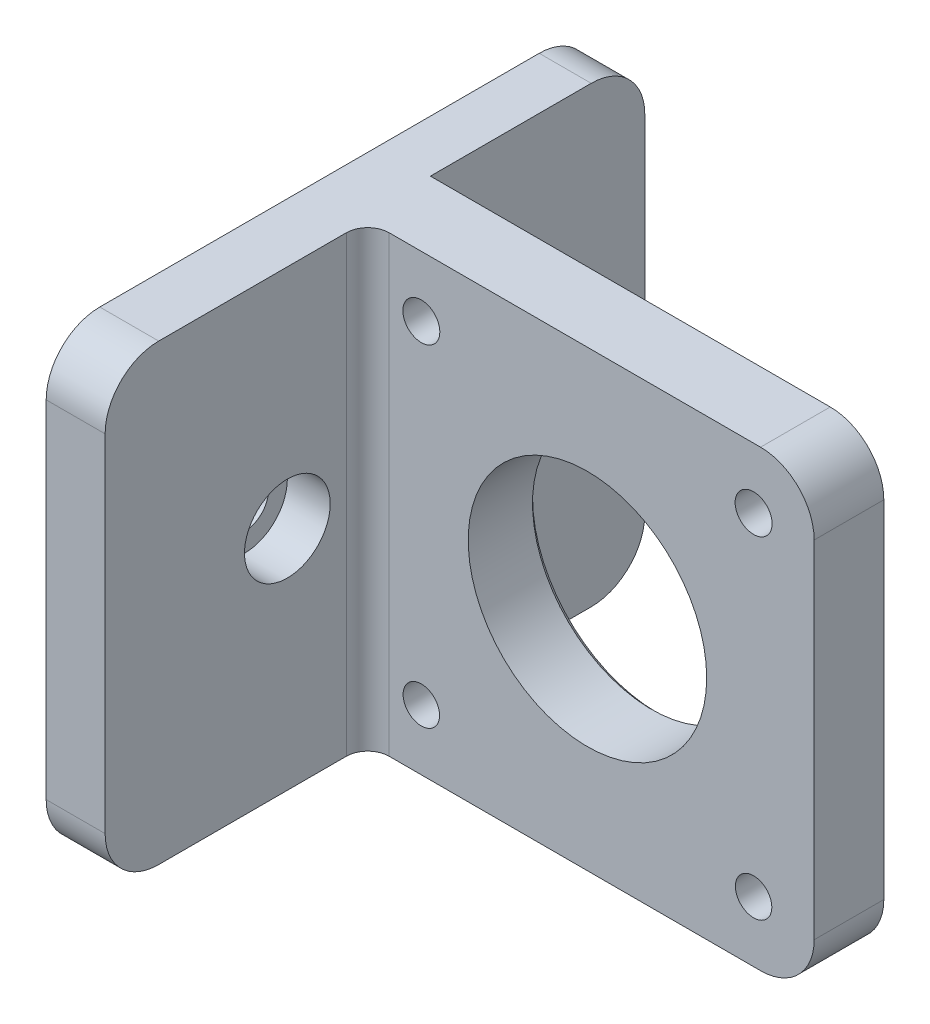
ISO-10303-21;
HEADER;
FILE_DESCRIPTION(('STEP AP214'),'2;1');
FILE_NAME('part.step','',(''),(''),'','','');
FILE_SCHEMA(('AUTOMOTIVE_DESIGN { 1 0 10303 214 1 1 1 1 }'));
ENDSEC;
DATA;
#1=APPLICATION_CONTEXT('core data for automotive mechanical design processes');
#2=APPLICATION_PROTOCOL_DEFINITION('international standard','automotive_design',2000,#1);
#3=PRODUCT_CONTEXT('',#1,'mechanical');
#4=PRODUCT('Part','Part','',(#3));
#5=PRODUCT_RELATED_PRODUCT_CATEGORY('part','',(#4));
#6=PRODUCT_DEFINITION_FORMATION('','',#4);
#7=PRODUCT_DEFINITION_CONTEXT('part definition',#1,'design');
#8=PRODUCT_DEFINITION('design','',#6,#7);
#9=PRODUCT_DEFINITION_SHAPE('','',#8);
#10=(LENGTH_UNIT() NAMED_UNIT(*) SI_UNIT(.MILLI.,.METRE.));
#11=(NAMED_UNIT(*) PLANE_ANGLE_UNIT() SI_UNIT($,.RADIAN.));
#12=(NAMED_UNIT(*) SI_UNIT($,.STERADIAN.) SOLID_ANGLE_UNIT());
#13=UNCERTAINTY_MEASURE_WITH_UNIT(LENGTH_MEASURE(1.E-05),#10,'distance_accuracy_value','');
#14=(GEOMETRIC_REPRESENTATION_CONTEXT(3) GLOBAL_UNCERTAINTY_ASSIGNED_CONTEXT((#13)) GLOBAL_UNIT_ASSIGNED_CONTEXT((#10,
#11,#12)) REPRESENTATION_CONTEXT('',''));
#15=CARTESIAN_POINT('',(0.,0.,0.));
#16=DIRECTION('',(0.,0.,1.));
#17=DIRECTION('',(1.,0.,0.));
#18=AXIS2_PLACEMENT_3D('',#15,#16,#17);
#19=CARTESIAN_POINT('',(21.15,21.15,2.));
#20=DIRECTION('',(-1.,0.,0.));
#21=DIRECTION('',(0.,-1.,0.));
#22=AXIS2_PLACEMENT_3D('',#19,#20,#21);
#23=PLANE('',#22);
#24=DIRECTION('',(0.,0.,-1.));
#25=VECTOR('',#24,1.);
#26=CARTESIAN_POINT('',(21.15,16.15,2.));
#27=LINE('',#26,#25);
#28=CARTESIAN_POINT('',(21.15,16.15,-2.));
#29=VERTEX_POINT('',#28);
#30=CARTESIAN_POINT('',(21.15,16.15,4.5));
#31=VERTEX_POINT('',#30);
#32=EDGE_CURVE('E286',#29,#31,#27,.F.);
#33=ORIENTED_EDGE('',*,*,#32,.T.);
#34=DIRECTION('',(0.,1.,0.));
#35=VECTOR('',#34,1.);
#36=CARTESIAN_POINT('',(21.15,-16.15,4.5));
#37=LINE('',#36,#35);
#38=CARTESIAN_POINT('',(21.15,-16.15,4.5));
#39=VERTEX_POINT('',#38);
#40=EDGE_CURVE('E218',#39,#31,#37,.T.);
#41=ORIENTED_EDGE('',*,*,#40,.F.);
#42=DIRECTION('',(0.,0.,-1.));
#43=VECTOR('',#42,1.);
#44=CARTESIAN_POINT('',(21.15,-16.15,2.));
#45=LINE('',#44,#43);
#46=CARTESIAN_POINT('',(21.15,-16.15,-2.));
#47=VERTEX_POINT('',#46);
#48=EDGE_CURVE('E288',#39,#47,#45,.T.);
#49=ORIENTED_EDGE('',*,*,#48,.T.);
#50=DIRECTION('',(0.,1.,0.));
#51=VECTOR('',#50,1.);
#52=CARTESIAN_POINT('',(21.15,21.15,-2.));
#53=LINE('',#52,#51);
#54=EDGE_CURVE('E276',#47,#29,#53,.T.);
#55=ORIENTED_EDGE('',*,*,#54,.T.);
#56=EDGE_LOOP('',(#33,#41,#49,#55));
#57=FACE_BOUND('',#56,.T.);
#58=ADVANCED_FACE('F43',(#57),#23,.F.);
#59=CARTESIAN_POINT('',(-21.15,21.15,2.));
#60=DIRECTION('',(0.,-1.,0.));
#61=DIRECTION('',(0.,0.,-1.));
#62=AXIS2_PLACEMENT_3D('',#59,#60,#61);
#63=PLANE('',#62);
#64=DIRECTION('',(0.,0.,-1.));
#65=VECTOR('',#64,1.);
#66=CARTESIAN_POINT('',(-26.,21.15,15.));
#67=LINE('',#66,#65);
#68=CARTESIAN_POINT('',(-26.,21.15,24.));
#69=VERTEX_POINT('',#68);
#70=CARTESIAN_POINT('',(-26.,21.15,-17.));
#71=VERTEX_POINT('',#70);
#72=EDGE_CURVE('E252',#69,#71,#67,.T.);
#73=ORIENTED_EDGE('',*,*,#72,.F.);
#74=DIRECTION('',(-1.,0.,0.));
#75=VECTOR('',#74,1.);
#76=CARTESIAN_POINT('',(-21.15,21.15,24.));
#77=LINE('',#76,#75);
#78=CARTESIAN_POINT('',(-20.5,21.15,24.));
#79=VERTEX_POINT('',#78);
#80=EDGE_CURVE('E314',#69,#79,#77,.F.);
#81=ORIENTED_EDGE('',*,*,#80,.T.);
#82=DIRECTION('',(0.,0.,1.));
#83=VECTOR('',#82,1.);
#84=CARTESIAN_POINT('',(-20.5,21.15,4.5));
#85=LINE('',#84,#83);
#86=CARTESIAN_POINT('',(-20.5,21.15,6.5));
#87=VERTEX_POINT('',#86);
#88=EDGE_CURVE('E174',#87,#79,#85,.T.);
#89=ORIENTED_EDGE('',*,*,#88,.F.);
#90=CARTESIAN_POINT('',(-18.5,21.15,6.5));
#91=DIRECTION('',(0.,-1.,0.));
#92=DIRECTION('',(0.,0.,-1.));
#93=AXIS2_PLACEMENT_3D('',#90,#91,#92);
#94=CIRCLE('',#93,2.);
#95=CARTESIAN_POINT('',(-18.5,21.15,4.5));
#96=VERTEX_POINT('',#95);
#97=EDGE_CURVE('E59',#87,#96,#94,.T.);
#98=ORIENTED_EDGE('',*,*,#97,.T.);
#99=DIRECTION('',(-1.,0.,0.));
#100=VECTOR('',#99,1.);
#101=CARTESIAN_POINT('',(16.15,21.15,4.5));
#102=LINE('',#101,#100);
#103=CARTESIAN_POINT('',(16.15,21.15,4.5));
#104=VERTEX_POINT('',#103);
#105=EDGE_CURVE('E224',#104,#96,#102,.T.);
#106=ORIENTED_EDGE('',*,*,#105,.F.);
#107=DIRECTION('',(0.,0.,-1.));
#108=VECTOR('',#107,1.);
#109=CARTESIAN_POINT('',(16.15,21.15,2.));
#110=LINE('',#109,#108);
#111=CARTESIAN_POINT('',(16.15,21.15,-2.));
#112=VERTEX_POINT('',#111);
#113=EDGE_CURVE('E297',#104,#112,#110,.T.);
#114=ORIENTED_EDGE('',*,*,#113,.T.);
#115=DIRECTION('',(-1.,0.,0.));
#116=VECTOR('',#115,1.);
#117=CARTESIAN_POINT('',(-21.15,21.15,-2.));
#118=LINE('',#117,#116);
#119=CARTESIAN_POINT('',(-21.15,21.15,-2.));
#120=VERTEX_POINT('',#119);
#121=EDGE_CURVE('E279',#112,#120,#118,.T.);
#122=ORIENTED_EDGE('',*,*,#121,.T.);
#123=DIRECTION('',(0.,0.,-1.));
#124=VECTOR('',#123,1.);
#125=CARTESIAN_POINT('',(-21.15,21.15,15.));
#126=LINE('',#125,#124);
#127=CARTESIAN_POINT('',(-21.15,21.15,-17.));
#128=VERTEX_POINT('',#127);
#129=EDGE_CURVE('E255',#120,#128,#126,.T.);
#130=ORIENTED_EDGE('',*,*,#129,.T.);
#131=DIRECTION('',(1.,0.,0.));
#132=VECTOR('',#131,1.);
#133=CARTESIAN_POINT('',(-26.,21.15,-17.));
#134=LINE('',#133,#132);
#135=EDGE_CURVE('E312',#128,#71,#134,.F.);
#136=ORIENTED_EDGE('',*,*,#135,.T.);
#137=EDGE_LOOP('',(#73,#81,#89,#98,#106,#114,#122,#130,#136));
#138=FACE_BOUND('',#137,.T.);
#139=ADVANCED_FACE('F348',(#138),#63,.F.);
#140=CARTESIAN_POINT('',(-21.15,-21.15,2.));
#141=DIRECTION('',(0.,1.,0.));
#142=DIRECTION('',(0.,0.,1.));
#143=AXIS2_PLACEMENT_3D('',#140,#141,#142);
#144=PLANE('',#143);
#145=DIRECTION('',(0.,0.,-1.));
#146=VECTOR('',#145,1.);
#147=CARTESIAN_POINT('',(16.15,-21.15,2.));
#148=LINE('',#147,#146);
#149=CARTESIAN_POINT('',(16.15,-21.15,-2.));
#150=VERTEX_POINT('',#149);
#151=CARTESIAN_POINT('',(16.15,-21.15,4.5));
#152=VERTEX_POINT('',#151);
#153=EDGE_CURVE('E295',#150,#152,#148,.F.);
#154=ORIENTED_EDGE('',*,*,#153,.T.);
#155=DIRECTION('',(1.,0.,0.));
#156=VECTOR('',#155,1.);
#157=CARTESIAN_POINT('',(-21.15,-21.15,4.5));
#158=LINE('',#157,#156);
#159=CARTESIAN_POINT('',(-18.5,-21.15,4.5));
#160=VERTEX_POINT('',#159);
#161=EDGE_CURVE('E213',#160,#152,#158,.T.);
#162=ORIENTED_EDGE('',*,*,#161,.F.);
#163=CARTESIAN_POINT('',(-18.5,-21.15,6.5));
#164=DIRECTION('',(0.,1.,0.));
#165=DIRECTION('',(0.,0.,1.));
#166=AXIS2_PLACEMENT_3D('',#163,#164,#165);
#167=CIRCLE('',#166,2.);
#168=CARTESIAN_POINT('',(-20.5,-21.15,6.5));
#169=VERTEX_POINT('',#168);
#170=EDGE_CURVE('E170',#160,#169,#167,.T.);
#171=ORIENTED_EDGE('',*,*,#170,.T.);
#172=DIRECTION('',(0.,0.,-1.));
#173=VECTOR('',#172,1.);
#174=CARTESIAN_POINT('',(-20.5,-21.15,24.));
#175=LINE('',#174,#173);
#176=CARTESIAN_POINT('',(-20.5,-21.15,24.));
#177=VERTEX_POINT('',#176);
#178=EDGE_CURVE('E166',#177,#169,#175,.T.);
#179=ORIENTED_EDGE('',*,*,#178,.F.);
#180=DIRECTION('',(1.,0.,0.));
#181=VECTOR('',#180,1.);
#182=CARTESIAN_POINT('',(-26.,-21.15,24.));
#183=LINE('',#182,#181);
#184=CARTESIAN_POINT('',(-26.,-21.15,24.));
#185=VERTEX_POINT('',#184);
#186=EDGE_CURVE('E152',#177,#185,#183,.F.);
#187=ORIENTED_EDGE('',*,*,#186,.T.);
#188=DIRECTION('',(0.,0.,-1.));
#189=VECTOR('',#188,1.);
#190=CARTESIAN_POINT('',(-26.,-21.15,15.));
#191=LINE('',#190,#189);
#192=CARTESIAN_POINT('',(-26.,-21.15,-17.));
#193=VERTEX_POINT('',#192);
#194=EDGE_CURVE('E250',#185,#193,#191,.T.);
#195=ORIENTED_EDGE('',*,*,#194,.T.);
#196=DIRECTION('',(-1.,0.,0.));
#197=VECTOR('',#196,1.);
#198=CARTESIAN_POINT('',(-21.15,-21.15,-17.));
#199=LINE('',#198,#197);
#200=CARTESIAN_POINT('',(-21.15,-21.15,-17.));
#201=VERTEX_POINT('',#200);
#202=EDGE_CURVE('E162',#193,#201,#199,.F.);
#203=ORIENTED_EDGE('',*,*,#202,.T.);
#204=DIRECTION('',(0.,0.,-1.));
#205=VECTOR('',#204,1.);
#206=CARTESIAN_POINT('',(-21.15,-21.15,15.));
#207=LINE('',#206,#205);
#208=CARTESIAN_POINT('',(-21.15,-21.15,-2.));
#209=VERTEX_POINT('',#208);
#210=EDGE_CURVE('E247',#209,#201,#207,.T.);
#211=ORIENTED_EDGE('',*,*,#210,.F.);
#212=DIRECTION('',(1.,0.,0.));
#213=VECTOR('',#212,1.);
#214=CARTESIAN_POINT('',(-21.15,-21.15,-2.));
#215=LINE('',#214,#213);
#216=EDGE_CURVE('E283',#209,#150,#215,.T.);
#217=ORIENTED_EDGE('',*,*,#216,.T.);
#218=EDGE_LOOP('',(#154,#162,#171,#179,#187,#195,#203,#211,#217));
#219=FACE_BOUND('',#218,.T.);
#220=ADVANCED_FACE('F168',(#219),#144,.F.);
#221=CARTESIAN_POINT('',(0.,0.,-2.));
#222=DIRECTION('',(0.,0.,1.));
#223=DIRECTION('',(1.,0.,0.));
#224=AXIS2_PLACEMENT_3D('',#221,#222,#223);
#225=PLANE('',#224);
#226=CARTESIAN_POINT('',(0.,0.,-2.));
#227=DIRECTION('',(0.,0.,1.));
#228=DIRECTION('',(1.,0.,0.));
#229=AXIS2_PLACEMENT_3D('',#226,#227,#228);
#230=CIRCLE('',#229,11.625);
#231=CARTESIAN_POINT('',(11.625,0.,-2.));
#232=VERTEX_POINT('',#231);
#233=EDGE_CURVE('E52',#232,#232,#230,.T.);
#234=ORIENTED_EDGE('',*,*,#233,.T.);
#235=EDGE_LOOP('',(#234));
#236=FACE_BOUND('',#235,.T.);
#237=CARTESIAN_POINT('',(-15.5,15.5,-2.));
#238=DIRECTION('',(0.,0.,1.));
#239=DIRECTION('',(1.,0.,0.));
#240=AXIS2_PLACEMENT_3D('',#237,#238,#239);
#241=CIRCLE('',#240,1.7);
#242=CARTESIAN_POINT('',(-13.8,15.5,-2.));
#243=VERTEX_POINT('',#242);
#244=EDGE_CURVE('E261',#243,#243,#241,.T.);
#245=ORIENTED_EDGE('',*,*,#244,.T.);
#246=EDGE_LOOP('',(#245));
#247=FACE_BOUND('',#246,.T.);
#248=CARTESIAN_POINT('',(15.5,15.5,-2.));
#249=DIRECTION('',(0.,0.,1.));
#250=DIRECTION('',(1.,0.,0.));
#251=AXIS2_PLACEMENT_3D('',#248,#249,#250);
#252=CIRCLE('',#251,1.7);
#253=CARTESIAN_POINT('',(17.2,15.5,-2.));
#254=VERTEX_POINT('',#253);
#255=EDGE_CURVE('E267',#254,#254,#252,.T.);
#256=ORIENTED_EDGE('',*,*,#255,.T.);
#257=EDGE_LOOP('',(#256));
#258=FACE_BOUND('',#257,.T.);
#259=CARTESIAN_POINT('',(15.5,-15.5,-2.));
#260=DIRECTION('',(0.,0.,1.));
#261=DIRECTION('',(1.,0.,0.));
#262=AXIS2_PLACEMENT_3D('',#259,#260,#261);
#263=CIRCLE('',#262,1.7);
#264=CARTESIAN_POINT('',(17.2,-15.5,-2.));
#265=VERTEX_POINT('',#264);
#266=EDGE_CURVE('E270',#265,#265,#263,.T.);
#267=ORIENTED_EDGE('',*,*,#266,.T.);
#268=EDGE_LOOP('',(#267));
#269=FACE_BOUND('',#268,.T.);
#270=CARTESIAN_POINT('',(-15.5,-15.5,-2.));
#271=DIRECTION('',(0.,0.,1.));
#272=DIRECTION('',(1.,0.,0.));
#273=AXIS2_PLACEMENT_3D('',#270,#271,#272);
#274=CIRCLE('',#273,1.7);
#275=CARTESIAN_POINT('',(-13.8,-15.5,-2.));
#276=VERTEX_POINT('',#275);
#277=EDGE_CURVE('E273',#276,#276,#274,.T.);
#278=ORIENTED_EDGE('',*,*,#277,.T.);
#279=EDGE_LOOP('',(#278));
#280=FACE_BOUND('',#279,.T.);
#281=ORIENTED_EDGE('',*,*,#54,.F.);
#282=CARTESIAN_POINT('',(16.15,-16.15,-2.));
#283=DIRECTION('',(0.,0.,1.));
#284=DIRECTION('',(1.,0.,0.));
#285=AXIS2_PLACEMENT_3D('',#282,#283,#284);
#286=CIRCLE('',#285,5.);
#287=EDGE_CURVE('E293',#47,#150,#286,.F.);
#288=ORIENTED_EDGE('',*,*,#287,.T.);
#289=ORIENTED_EDGE('',*,*,#216,.F.);
#290=DIRECTION('',(0.,-1.,0.));
#291=VECTOR('',#290,1.);
#292=CARTESIAN_POINT('',(-21.15,21.15,-2.));
#293=LINE('',#292,#291);
#294=EDGE_CURVE('E281',#120,#209,#293,.T.);
#295=ORIENTED_EDGE('',*,*,#294,.F.);
#296=ORIENTED_EDGE('',*,*,#121,.F.);
#297=CARTESIAN_POINT('',(16.15,16.15,-2.));
#298=DIRECTION('',(0.,0.,1.));
#299=DIRECTION('',(1.,0.,0.));
#300=AXIS2_PLACEMENT_3D('',#297,#298,#299);
#301=CIRCLE('',#300,5.);
#302=EDGE_CURVE('E291',#112,#29,#301,.F.);
#303=ORIENTED_EDGE('',*,*,#302,.T.);
#304=EDGE_LOOP('',(#281,#288,#289,#295,#296,#303));
#305=FACE_BOUND('',#304,.T.);
#306=ADVANCED_FACE('F334',(#236,#247,#258,#269,#280,#305),#225,.F.);
#307=CARTESIAN_POINT('',(-15.5,-15.5,2.));
#308=DIRECTION('',(0.,0.,1.));
#309=DIRECTION('',(1.,0.,0.));
#310=AXIS2_PLACEMENT_3D('',#307,#308,#309);
#311=CYLINDRICAL_SURFACE('',#310,1.7);
#312=ORIENTED_EDGE('',*,*,#277,.F.);
#313=EDGE_LOOP('',(#312));
#314=FACE_BOUND('',#313,.T.);
#315=CARTESIAN_POINT('',(-15.5,-15.5,4.5));
#316=DIRECTION('',(0.,0.,1.));
#317=DIRECTION('',(1.,0.,0.));
#318=AXIS2_PLACEMENT_3D('',#315,#316,#317);
#319=CIRCLE('',#318,1.7);
#320=CARTESIAN_POINT('',(-13.8,-15.5,4.5));
#321=VERTEX_POINT('',#320);
#322=EDGE_CURVE('E195',#321,#321,#319,.T.);
#323=ORIENTED_EDGE('',*,*,#322,.T.);
#324=EDGE_LOOP('',(#323));
#325=FACE_BOUND('',#324,.T.);
#326=ADVANCED_FACE('F448',(#314,#325),#311,.F.);
#327=CARTESIAN_POINT('',(15.5,-15.5,2.));
#328=DIRECTION('',(0.,0.,1.));
#329=DIRECTION('',(1.,0.,0.));
#330=AXIS2_PLACEMENT_3D('',#327,#328,#329);
#331=CYLINDRICAL_SURFACE('',#330,1.7);
#332=ORIENTED_EDGE('',*,*,#266,.F.);
#333=EDGE_LOOP('',(#332));
#334=FACE_BOUND('',#333,.T.);
#335=CARTESIAN_POINT('',(15.5,-15.5,4.5));
#336=DIRECTION('',(0.,0.,1.));
#337=DIRECTION('',(1.,0.,0.));
#338=AXIS2_PLACEMENT_3D('',#335,#336,#337);
#339=CIRCLE('',#338,1.7);
#340=CARTESIAN_POINT('',(17.2,-15.5,4.5));
#341=VERTEX_POINT('',#340);
#342=EDGE_CURVE('E192',#341,#341,#339,.T.);
#343=ORIENTED_EDGE('',*,*,#342,.T.);
#344=EDGE_LOOP('',(#343));
#345=FACE_BOUND('',#344,.T.);
#346=ADVANCED_FACE('F444',(#334,#345),#331,.F.);
#347=CARTESIAN_POINT('',(15.5,15.5,2.));
#348=DIRECTION('',(0.,0.,1.));
#349=DIRECTION('',(1.,0.,0.));
#350=AXIS2_PLACEMENT_3D('',#347,#348,#349);
#351=CYLINDRICAL_SURFACE('',#350,1.7);
#352=ORIENTED_EDGE('',*,*,#255,.F.);
#353=EDGE_LOOP('',(#352));
#354=FACE_BOUND('',#353,.T.);
#355=CARTESIAN_POINT('',(15.5,15.5,1.975));
#356=DIRECTION('',(0.,0.,1.));
#357=DIRECTION('',(1.,0.,0.));
#358=AXIS2_PLACEMENT_3D('',#355,#356,#357);
#359=CIRCLE('',#358,1.7);
#360=CARTESIAN_POINT('',(17.2,15.5,1.975));
#361=VERTEX_POINT('',#360);
#362=EDGE_CURVE('E264',#361,#361,#359,.T.);
#363=ORIENTED_EDGE('',*,*,#362,.T.);
#364=EDGE_LOOP('',(#363));
#365=FACE_BOUND('',#364,.T.);
#366=ADVANCED_FACE('F440',(#354,#365),#351,.F.);
#367=CARTESIAN_POINT('',(15.5,15.5,2.));
#368=DIRECTION('',(0.,0.,1.));
#369=DIRECTION('',(1.,0.,0.));
#370=AXIS2_PLACEMENT_3D('',#367,#368,#369);
#371=CONICAL_SURFACE('',#370,1.725,0.785398163397448);
#372=ORIENTED_EDGE('',*,*,#362,.F.);
#373=EDGE_LOOP('',(#372));
#374=FACE_BOUND('',#373,.T.);
#375=CARTESIAN_POINT('',(15.5,15.5,2.));
#376=DIRECTION('',(0.,0.,1.));
#377=DIRECTION('',(1.,0.,0.));
#378=AXIS2_PLACEMENT_3D('',#375,#376,#377);
#379=CIRCLE('',#378,1.725);
#380=CARTESIAN_POINT('',(17.225,15.5,2.));
#381=VERTEX_POINT('',#380);
#382=EDGE_CURVE('E202',#381,#381,#379,.T.);
#383=ORIENTED_EDGE('',*,*,#382,.T.);
#384=EDGE_LOOP('',(#383));
#385=FACE_BOUND('',#384,.T.);
#386=ADVANCED_FACE('F436',(#374,#385),#371,.F.);
#387=CARTESIAN_POINT('',(-15.5,15.5,2.));
#388=DIRECTION('',(0.,0.,1.));
#389=DIRECTION('',(1.,0.,0.));
#390=AXIS2_PLACEMENT_3D('',#387,#388,#389);
#391=CYLINDRICAL_SURFACE('',#390,1.7);
#392=ORIENTED_EDGE('',*,*,#244,.F.);
#393=EDGE_LOOP('',(#392));
#394=FACE_BOUND('',#393,.T.);
#395=CARTESIAN_POINT('',(-15.5,15.5,1.975));
#396=DIRECTION('',(0.,0.,1.));
#397=DIRECTION('',(1.,0.,0.));
#398=AXIS2_PLACEMENT_3D('',#395,#396,#397);
#399=CIRCLE('',#398,1.7);
#400=CARTESIAN_POINT('',(-13.8,15.5,1.975));
#401=VERTEX_POINT('',#400);
#402=EDGE_CURVE('E258',#401,#401,#399,.T.);
#403=ORIENTED_EDGE('',*,*,#402,.T.);
#404=EDGE_LOOP('',(#403));
#405=FACE_BOUND('',#404,.T.);
#406=ADVANCED_FACE('F432',(#394,#405),#391,.F.);
#407=CARTESIAN_POINT('',(-15.5,15.5,2.));
#408=DIRECTION('',(0.,0.,1.));
#409=DIRECTION('',(1.,0.,0.));
#410=AXIS2_PLACEMENT_3D('',#407,#408,#409);
#411=CONICAL_SURFACE('',#410,1.725,0.785398163397448);
#412=ORIENTED_EDGE('',*,*,#402,.F.);
#413=EDGE_LOOP('',(#412));
#414=FACE_BOUND('',#413,.T.);
#415=CARTESIAN_POINT('',(-15.5,15.5,2.));
#416=DIRECTION('',(0.,0.,1.));
#417=DIRECTION('',(1.,0.,0.));
#418=AXIS2_PLACEMENT_3D('',#415,#416,#417);
#419=CIRCLE('',#418,1.725);
#420=CARTESIAN_POINT('',(-13.775,15.5,2.));
#421=VERTEX_POINT('',#420);
#422=EDGE_CURVE('E198',#421,#421,#419,.T.);
#423=ORIENTED_EDGE('',*,*,#422,.T.);
#424=EDGE_LOOP('',(#423));
#425=FACE_BOUND('',#424,.T.);
#426=ADVANCED_FACE('F428',(#414,#425),#411,.F.);
#427=CARTESIAN_POINT('',(0.,0.,-2.));
#428=DIRECTION('',(0.,0.,1.));
#429=DIRECTION('',(1.,0.,0.));
#430=AXIS2_PLACEMENT_3D('',#427,#428,#429);
#431=CYLINDRICAL_SURFACE('',#430,11.125);
#432=CARTESIAN_POINT('',(0.,0.,-1.5));
#433=DIRECTION('',(0.,0.,1.));
#434=DIRECTION('',(1.,0.,0.));
#435=AXIS2_PLACEMENT_3D('',#432,#433,#434);
#436=CIRCLE('',#435,11.125);
#437=CARTESIAN_POINT('',(11.125,0.,-1.5));
#438=VERTEX_POINT('',#437);
#439=EDGE_CURVE('E11',#438,#438,#436,.F.);
#440=ORIENTED_EDGE('',*,*,#439,.T.);
#441=EDGE_LOOP('',(#440));
#442=FACE_BOUND('',#441,.T.);
#443=CARTESIAN_POINT('',(0.,0.,4.5));
#444=DIRECTION('',(0.,0.,1.));
#445=DIRECTION('',(1.,0.,0.));
#446=AXIS2_PLACEMENT_3D('',#443,#444,#445);
#447=CIRCLE('',#446,11.125);
#448=CARTESIAN_POINT('',(11.125,0.,4.5));
#449=VERTEX_POINT('',#448);
#450=EDGE_CURVE('E208',#449,#449,#447,.T.);
#451=ORIENTED_EDGE('',*,*,#450,.T.);
#452=EDGE_LOOP('',(#451));
#453=FACE_BOUND('',#452,.T.);
#454=ADVANCED_FACE('F425',(#442,#453),#431,.F.);
#455=CARTESIAN_POINT('',(-21.15,21.15,15.));
#456=DIRECTION('',(-1.,0.,0.));
#457=DIRECTION('',(0.,-1.,0.));
#458=AXIS2_PLACEMENT_3D('',#455,#456,#457);
#459=PLANE('',#458);
#460=CARTESIAN_POINT('',(-21.15,0.,-12.));
#461=DIRECTION('',(1.,0.,0.));
#462=DIRECTION('',(0.,0.,-1.));
#463=AXIS2_PLACEMENT_3D('',#460,#461,#462);
#464=CIRCLE('',#463,4.);
#465=CARTESIAN_POINT('',(-21.15,0.,-16.));
#466=VERTEX_POINT('',#465);
#467=EDGE_CURVE('E226',#466,#466,#464,.T.);
#468=ORIENTED_EDGE('',*,*,#467,.F.);
#469=EDGE_LOOP('',(#468));
#470=FACE_BOUND('',#469,.T.);
#471=DIRECTION('',(0.,-1.,0.));
#472=VECTOR('',#471,1.);
#473=CARTESIAN_POINT('',(-21.15,21.15,-22.));
#474=LINE('',#473,#472);
#475=CARTESIAN_POINT('',(-21.15,16.15,-22.));
#476=VERTEX_POINT('',#475);
#477=CARTESIAN_POINT('',(-21.15,-16.15,-22.));
#478=VERTEX_POINT('',#477);
#479=EDGE_CURVE('E241',#476,#478,#474,.T.);
#480=ORIENTED_EDGE('',*,*,#479,.F.);
#481=CARTESIAN_POINT('',(-21.15,16.15,-17.));
#482=DIRECTION('',(-1.,0.,0.));
#483=DIRECTION('',(0.,-1.,0.));
#484=AXIS2_PLACEMENT_3D('',#481,#482,#483);
#485=CIRCLE('',#484,5.);
#486=EDGE_CURVE('E163',#476,#128,#485,.F.);
#487=ORIENTED_EDGE('',*,*,#486,.T.);
#488=ORIENTED_EDGE('',*,*,#129,.F.);
#489=ORIENTED_EDGE('',*,*,#294,.T.);
#490=ORIENTED_EDGE('',*,*,#210,.T.);
#491=CARTESIAN_POINT('',(-21.15,-16.15,-17.));
#492=DIRECTION('',(-1.,0.,0.));
#493=DIRECTION('',(0.,-1.,0.));
#494=AXIS2_PLACEMENT_3D('',#491,#492,#493);
#495=CIRCLE('',#494,5.);
#496=EDGE_CURVE('E323',#201,#478,#495,.F.);
#497=ORIENTED_EDGE('',*,*,#496,.T.);
#498=EDGE_LOOP('',(#480,#487,#488,#489,#490,#497));
#499=FACE_BOUND('',#498,.T.);
#500=ADVANCED_FACE('F421',(#470,#499),#459,.F.);
#501=CARTESIAN_POINT('',(-26.,21.15,15.));
#502=DIRECTION('',(1.,0.,0.));
#503=DIRECTION('',(0.,1.,0.));
#504=AXIS2_PLACEMENT_3D('',#501,#502,#503);
#505=PLANE('',#504);
#506=CARTESIAN_POINT('',(-26.,0.,12.));
#507=DIRECTION('',(1.,0.,0.));
#508=DIRECTION('',(0.,0.,-1.));
#509=AXIS2_PLACEMENT_3D('',#506,#507,#508);
#510=CIRCLE('',#509,2.25);
#511=CARTESIAN_POINT('',(-26.,0.,9.75));
#512=VERTEX_POINT('',#511);
#513=EDGE_CURVE('E181',#512,#512,#510,.T.);
#514=ORIENTED_EDGE('',*,*,#513,.T.);
#515=EDGE_LOOP('',(#514));
#516=FACE_BOUND('',#515,.T.);
#517=CARTESIAN_POINT('',(-26.,0.,-12.));
#518=DIRECTION('',(1.,0.,0.));
#519=DIRECTION('',(0.,0.,-1.));
#520=AXIS2_PLACEMENT_3D('',#517,#518,#519);
#521=CIRCLE('',#520,2.25);
#522=CARTESIAN_POINT('',(-26.,0.,-14.25));
#523=VERTEX_POINT('',#522);
#524=EDGE_CURVE('E235',#523,#523,#521,.T.);
#525=ORIENTED_EDGE('',*,*,#524,.T.);
#526=EDGE_LOOP('',(#525));
#527=FACE_BOUND('',#526,.T.);
#528=DIRECTION('',(0.,-1.,0.));
#529=VECTOR('',#528,1.);
#530=CARTESIAN_POINT('',(-26.,21.15,29.));
#531=LINE('',#530,#529);
#532=CARTESIAN_POINT('',(-26.,16.15,29.));
#533=VERTEX_POINT('',#532);
#534=CARTESIAN_POINT('',(-26.,-16.15,29.));
#535=VERTEX_POINT('',#534);
#536=EDGE_CURVE('E238',#533,#535,#531,.T.);
#537=ORIENTED_EDGE('',*,*,#536,.F.);
#538=CARTESIAN_POINT('',(-26.,16.15,24.));
#539=DIRECTION('',(1.,0.,0.));
#540=DIRECTION('',(0.,1.,0.));
#541=AXIS2_PLACEMENT_3D('',#538,#539,#540);
#542=CIRCLE('',#541,5.);
#543=EDGE_CURVE('E310',#533,#69,#542,.F.);
#544=ORIENTED_EDGE('',*,*,#543,.T.);
#545=ORIENTED_EDGE('',*,*,#72,.T.);
#546=CARTESIAN_POINT('',(-26.,16.15,-17.));
#547=DIRECTION('',(1.,0.,0.));
#548=DIRECTION('',(0.,1.,0.));
#549=AXIS2_PLACEMENT_3D('',#546,#547,#548);
#550=CIRCLE('',#549,5.);
#551=CARTESIAN_POINT('',(-26.,16.15,-22.));
#552=VERTEX_POINT('',#551);
#553=EDGE_CURVE('E308',#71,#552,#550,.F.);
#554=ORIENTED_EDGE('',*,*,#553,.T.);
#555=DIRECTION('',(0.,1.,0.));
#556=VECTOR('',#555,1.);
#557=CARTESIAN_POINT('',(-26.,-21.15,-22.));
#558=LINE('',#557,#556);
#559=CARTESIAN_POINT('',(-26.,-16.15,-22.));
#560=VERTEX_POINT('',#559);
#561=EDGE_CURVE('E244',#560,#552,#558,.T.);
#562=ORIENTED_EDGE('',*,*,#561,.F.);
#563=CARTESIAN_POINT('',(-26.,-16.15,-17.));
#564=DIRECTION('',(1.,0.,0.));
#565=DIRECTION('',(0.,1.,0.));
#566=AXIS2_PLACEMENT_3D('',#563,#564,#565);
#567=CIRCLE('',#566,5.);
#568=EDGE_CURVE('E306',#560,#193,#567,.F.);
#569=ORIENTED_EDGE('',*,*,#568,.T.);
#570=ORIENTED_EDGE('',*,*,#194,.F.);
#571=CARTESIAN_POINT('',(-26.,-16.15,24.));
#572=DIRECTION('',(1.,0.,0.));
#573=DIRECTION('',(0.,1.,0.));
#574=AXIS2_PLACEMENT_3D('',#571,#572,#573);
#575=CIRCLE('',#574,5.);
#576=EDGE_CURVE('E158',#185,#535,#575,.F.);
#577=ORIENTED_EDGE('',*,*,#576,.T.);
#578=EDGE_LOOP('',(#537,#544,#545,#554,#562,#569,#570,#577));
#579=FACE_BOUND('',#578,.T.);
#580=ADVANCED_FACE('F363',(#516,#527,#579),#505,.F.);
#581=CARTESIAN_POINT('',(16.15,-16.15,2.));
#582=DIRECTION('',(0.,0.,-1.));
#583=DIRECTION('',(-1.,0.,0.));
#584=AXIS2_PLACEMENT_3D('',#581,#582,#583);
#585=CYLINDRICAL_SURFACE('',#584,5.);
#586=ORIENTED_EDGE('',*,*,#48,.F.);
#587=CARTESIAN_POINT('',(16.15,-16.15,4.5));
#588=DIRECTION('',(0.,0.,1.));
#589=DIRECTION('',(1.,0.,0.));
#590=AXIS2_PLACEMENT_3D('',#587,#588,#589);
#591=CIRCLE('',#590,5.);
#592=EDGE_CURVE('E215',#152,#39,#591,.T.);
#593=ORIENTED_EDGE('',*,*,#592,.F.);
#594=ORIENTED_EDGE('',*,*,#153,.F.);
#595=ORIENTED_EDGE('',*,*,#287,.F.);
#596=EDGE_LOOP('',(#586,#593,#594,#595));
#597=FACE_BOUND('',#596,.T.);
#598=ADVANCED_FACE('F359',(#597),#585,.T.);
#599=CARTESIAN_POINT('',(16.15,16.15,2.));
#600=DIRECTION('',(0.,0.,-1.));
#601=DIRECTION('',(-1.,0.,0.));
#602=AXIS2_PLACEMENT_3D('',#599,#600,#601);
#603=CYLINDRICAL_SURFACE('',#602,5.);
#604=ORIENTED_EDGE('',*,*,#113,.F.);
#605=CARTESIAN_POINT('',(16.15,16.15,4.5));
#606=DIRECTION('',(0.,0.,1.));
#607=DIRECTION('',(1.,0.,0.));
#608=AXIS2_PLACEMENT_3D('',#605,#606,#607);
#609=CIRCLE('',#608,5.);
#610=EDGE_CURVE('E221',#31,#104,#609,.T.);
#611=ORIENTED_EDGE('',*,*,#610,.F.);
#612=ORIENTED_EDGE('',*,*,#32,.F.);
#613=ORIENTED_EDGE('',*,*,#302,.F.);
#614=EDGE_LOOP('',(#604,#611,#612,#613));
#615=FACE_BOUND('',#614,.T.);
#616=ADVANCED_FACE('F362',(#615),#603,.T.);
#617=CARTESIAN_POINT('',(0.,0.,-22.));
#618=DIRECTION('',(0.,0.,-1.));
#619=DIRECTION('',(-1.,0.,0.));
#620=AXIS2_PLACEMENT_3D('',#617,#618,#619);
#621=PLANE('',#620);
#622=ORIENTED_EDGE('',*,*,#561,.T.);
#623=DIRECTION('',(1.,0.,0.));
#624=VECTOR('',#623,1.);
#625=CARTESIAN_POINT('',(-21.15,16.15,-22.));
#626=LINE('',#625,#624);
#627=EDGE_CURVE('E320',#552,#476,#626,.T.);
#628=ORIENTED_EDGE('',*,*,#627,.T.);
#629=ORIENTED_EDGE('',*,*,#479,.T.);
#630=DIRECTION('',(-1.,0.,0.));
#631=VECTOR('',#630,1.);
#632=CARTESIAN_POINT('',(-26.,-16.15,-22.));
#633=LINE('',#632,#631);
#634=EDGE_CURVE('E317',#478,#560,#633,.T.);
#635=ORIENTED_EDGE('',*,*,#634,.T.);
#636=EDGE_LOOP('',(#622,#628,#629,#635));
#637=FACE_BOUND('',#636,.T.);
#638=ADVANCED_FACE('F367',(#637),#621,.T.);
#639=CARTESIAN_POINT('',(0.,0.,29.));
#640=DIRECTION('',(0.,0.,1.));
#641=DIRECTION('',(1.,0.,0.));
#642=AXIS2_PLACEMENT_3D('',#639,#640,#641);
#643=PLANE('',#642);
#644=DIRECTION('',(1.,0.,0.));
#645=VECTOR('',#644,1.);
#646=CARTESIAN_POINT('',(-21.15,-16.15,29.));
#647=LINE('',#646,#645);
#648=CARTESIAN_POINT('',(-20.5,-16.15,29.));
#649=VERTEX_POINT('',#648);
#650=EDGE_CURVE('E300',#535,#649,#647,.T.);
#651=ORIENTED_EDGE('',*,*,#650,.T.);
#652=DIRECTION('',(0.,-1.,0.));
#653=VECTOR('',#652,1.);
#654=CARTESIAN_POINT('',(-20.5,16.15,29.));
#655=LINE('',#654,#653);
#656=CARTESIAN_POINT('',(-20.5,16.15,29.));
#657=VERTEX_POINT('',#656);
#658=EDGE_CURVE('E180',#657,#649,#655,.T.);
#659=ORIENTED_EDGE('',*,*,#658,.F.);
#660=DIRECTION('',(-1.,0.,0.));
#661=VECTOR('',#660,1.);
#662=CARTESIAN_POINT('',(-26.,16.15,29.));
#663=LINE('',#662,#661);
#664=EDGE_CURVE('E302',#657,#533,#663,.T.);
#665=ORIENTED_EDGE('',*,*,#664,.T.);
#666=ORIENTED_EDGE('',*,*,#536,.T.);
#667=EDGE_LOOP('',(#651,#659,#665,#666));
#668=FACE_BOUND('',#667,.T.);
#669=ADVANCED_FACE('F412',(#668),#643,.T.);
#670=CARTESIAN_POINT('',(-21.15,0.,-12.));
#671=DIRECTION('',(1.,0.,0.));
#672=DIRECTION('',(0.,0.,-1.));
#673=AXIS2_PLACEMENT_3D('',#670,#671,#672);
#674=CYLINDRICAL_SURFACE('',#673,2.25);
#675=ORIENTED_EDGE('',*,*,#524,.F.);
#676=EDGE_LOOP('',(#675));
#677=FACE_BOUND('',#676,.T.);
#678=CARTESIAN_POINT('',(-25.15,0.,-12.));
#679=DIRECTION('',(1.,0.,0.));
#680=DIRECTION('',(0.,0.,-1.));
#681=AXIS2_PLACEMENT_3D('',#678,#679,#680);
#682=CIRCLE('',#681,2.25);
#683=CARTESIAN_POINT('',(-25.15,0.,-14.25));
#684=VERTEX_POINT('',#683);
#685=EDGE_CURVE('E232',#684,#684,#682,.T.);
#686=ORIENTED_EDGE('',*,*,#685,.T.);
#687=EDGE_LOOP('',(#686));
#688=FACE_BOUND('',#687,.T.);
#689=ADVANCED_FACE('F408',(#677,#688),#674,.F.);
#690=CARTESIAN_POINT('',(-25.15,2.25,-12.));
#691=DIRECTION('',(-1.,0.,0.));
#692=DIRECTION('',(0.,0.,1.));
#693=AXIS2_PLACEMENT_3D('',#690,#691,#692);
#694=PLANE('',#693);
#695=ORIENTED_EDGE('',*,*,#685,.F.);
#696=EDGE_LOOP('',(#695));
#697=FACE_BOUND('',#696,.T.);
#698=CARTESIAN_POINT('',(-25.15,0.,-12.));
#699=DIRECTION('',(1.,0.,0.));
#700=DIRECTION('',(0.,0.,-1.));
#701=AXIS2_PLACEMENT_3D('',#698,#699,#700);
#702=CIRCLE('',#701,4.);
#703=CARTESIAN_POINT('',(-25.15,0.,-16.));
#704=VERTEX_POINT('',#703);
#705=EDGE_CURVE('E229',#704,#704,#702,.T.);
#706=ORIENTED_EDGE('',*,*,#705,.T.);
#707=EDGE_LOOP('',(#706));
#708=FACE_BOUND('',#707,.T.);
#709=ADVANCED_FACE('F404',(#697,#708),#694,.F.);
#710=CARTESIAN_POINT('',(-21.15,0.,-12.));
#711=DIRECTION('',(1.,0.,0.));
#712=DIRECTION('',(0.,0.,-1.));
#713=AXIS2_PLACEMENT_3D('',#710,#711,#712);
#714=CYLINDRICAL_SURFACE('',#713,4.);
#715=ORIENTED_EDGE('',*,*,#705,.F.);
#716=EDGE_LOOP('',(#715));
#717=FACE_BOUND('',#716,.T.);
#718=ORIENTED_EDGE('',*,*,#467,.T.);
#719=EDGE_LOOP('',(#718));
#720=FACE_BOUND('',#719,.T.);
#721=ADVANCED_FACE('F373',(#717,#720),#714,.F.);
#722=CARTESIAN_POINT('',(0.,16.15,24.));
#723=DIRECTION('',(1.,0.,0.));
#724=DIRECTION('',(0.,0.,-1.));
#725=AXIS2_PLACEMENT_3D('',#722,#723,#724);
#726=CYLINDRICAL_SURFACE('',#725,5.);
#727=ORIENTED_EDGE('',*,*,#664,.F.);
#728=CARTESIAN_POINT('',(-20.5,16.15,24.));
#729=DIRECTION('',(1.,0.,0.));
#730=DIRECTION('',(0.,1.,0.));
#731=AXIS2_PLACEMENT_3D('',#728,#729,#730);
#732=CIRCLE('',#731,5.);
#733=EDGE_CURVE('E189',#79,#657,#732,.T.);
#734=ORIENTED_EDGE('',*,*,#733,.F.);
#735=ORIENTED_EDGE('',*,*,#80,.F.);
#736=ORIENTED_EDGE('',*,*,#543,.F.);
#737=EDGE_LOOP('',(#727,#734,#735,#736));
#738=FACE_BOUND('',#737,.T.);
#739=ADVANCED_FACE('F369',(#738),#726,.T.);
#740=CARTESIAN_POINT('',(0.,16.15,-17.));
#741=DIRECTION('',(-1.,0.,0.));
#742=DIRECTION('',(0.,0.,1.));
#743=AXIS2_PLACEMENT_3D('',#740,#741,#742);
#744=CYLINDRICAL_SURFACE('',#743,5.);
#745=ORIENTED_EDGE('',*,*,#553,.F.);
#746=ORIENTED_EDGE('',*,*,#135,.F.);
#747=ORIENTED_EDGE('',*,*,#486,.F.);
#748=ORIENTED_EDGE('',*,*,#627,.F.);
#749=EDGE_LOOP('',(#745,#746,#747,#748));
#750=FACE_BOUND('',#749,.T.);
#751=ADVANCED_FACE('F372',(#750),#744,.T.);
#752=CARTESIAN_POINT('',(0.,-16.15,-17.));
#753=DIRECTION('',(1.,0.,0.));
#754=DIRECTION('',(0.,0.,-1.));
#755=AXIS2_PLACEMENT_3D('',#752,#753,#754);
#756=CYLINDRICAL_SURFACE('',#755,5.);
#757=ORIENTED_EDGE('',*,*,#496,.F.);
#758=ORIENTED_EDGE('',*,*,#202,.F.);
#759=ORIENTED_EDGE('',*,*,#568,.F.);
#760=ORIENTED_EDGE('',*,*,#634,.F.);
#761=EDGE_LOOP('',(#757,#758,#759,#760));
#762=FACE_BOUND('',#761,.T.);
#763=ADVANCED_FACE('F377',(#762),#756,.T.);
#764=CARTESIAN_POINT('',(0.,-16.15,24.));
#765=DIRECTION('',(-1.,0.,0.));
#766=DIRECTION('',(0.,0.,1.));
#767=AXIS2_PLACEMENT_3D('',#764,#765,#766);
#768=CYLINDRICAL_SURFACE('',#767,5.);
#769=ORIENTED_EDGE('',*,*,#576,.F.);
#770=ORIENTED_EDGE('',*,*,#186,.F.);
#771=CARTESIAN_POINT('',(-20.5,-16.15,24.));
#772=DIRECTION('',(1.,0.,0.));
#773=DIRECTION('',(0.,1.,0.));
#774=AXIS2_PLACEMENT_3D('',#771,#772,#773);
#775=CIRCLE('',#774,5.);
#776=EDGE_CURVE('E157',#649,#177,#775,.T.);
#777=ORIENTED_EDGE('',*,*,#776,.F.);
#778=ORIENTED_EDGE('',*,*,#650,.F.);
#779=EDGE_LOOP('',(#769,#770,#777,#778));
#780=FACE_BOUND('',#779,.T.);
#781=ADVANCED_FACE('F154',(#780),#768,.T.);
#782=CARTESIAN_POINT('',(-15.5,15.5,4.5));
#783=DIRECTION('',(0.,0.,-1.));
#784=DIRECTION('',(-1.,0.,0.));
#785=AXIS2_PLACEMENT_3D('',#782,#783,#784);
#786=CYLINDRICAL_SURFACE('',#785,1.725);
#787=CARTESIAN_POINT('',(-15.5,15.5,4.5));
#788=DIRECTION('',(0.,0.,1.));
#789=DIRECTION('',(1.,0.,0.));
#790=AXIS2_PLACEMENT_3D('',#787,#788,#789);
#791=CIRCLE('',#790,1.725);
#792=CARTESIAN_POINT('',(-13.775,15.5,4.5));
#793=VERTEX_POINT('',#792);
#794=EDGE_CURVE('E199',#793,#793,#791,.T.);
#795=ORIENTED_EDGE('',*,*,#794,.T.);
#796=EDGE_LOOP('',(#795));
#797=FACE_BOUND('',#796,.T.);
#798=ORIENTED_EDGE('',*,*,#422,.F.);
#799=EDGE_LOOP('',(#798));
#800=FACE_BOUND('',#799,.T.);
#801=ADVANCED_FACE('F382',(#797,#800),#786,.F.);
#802=CARTESIAN_POINT('',(15.5,15.5,4.5));
#803=DIRECTION('',(0.,0.,-1.));
#804=DIRECTION('',(-1.,0.,0.));
#805=AXIS2_PLACEMENT_3D('',#802,#803,#804);
#806=CYLINDRICAL_SURFACE('',#805,1.725);
#807=CARTESIAN_POINT('',(15.5,15.5,4.5));
#808=DIRECTION('',(0.,0.,1.));
#809=DIRECTION('',(1.,0.,0.));
#810=AXIS2_PLACEMENT_3D('',#807,#808,#809);
#811=CIRCLE('',#810,1.725);
#812=CARTESIAN_POINT('',(17.225,15.5,4.5));
#813=VERTEX_POINT('',#812);
#814=EDGE_CURVE('E205',#813,#813,#811,.T.);
#815=ORIENTED_EDGE('',*,*,#814,.T.);
#816=EDGE_LOOP('',(#815));
#817=FACE_BOUND('',#816,.T.);
#818=ORIENTED_EDGE('',*,*,#382,.F.);
#819=EDGE_LOOP('',(#818));
#820=FACE_BOUND('',#819,.T.);
#821=ADVANCED_FACE('F387',(#817,#820),#806,.F.);
#822=CARTESIAN_POINT('',(16.15,-16.15,4.5));
#823=DIRECTION('',(0.,0.,1.));
#824=DIRECTION('',(1.,0.,0.));
#825=AXIS2_PLACEMENT_3D('',#822,#823,#824);
#826=PLANE('',#825);
#827=ORIENTED_EDGE('',*,*,#105,.T.);
#828=DIRECTION('',(0.,1.,0.));
#829=VECTOR('',#828,1.);
#830=CARTESIAN_POINT('',(-18.5,-21.15,4.5));
#831=LINE('',#830,#829);
#832=EDGE_CURVE('E66',#96,#160,#831,.F.);
#833=ORIENTED_EDGE('',*,*,#832,.T.);
#834=ORIENTED_EDGE('',*,*,#161,.T.);
#835=ORIENTED_EDGE('',*,*,#592,.T.);
#836=ORIENTED_EDGE('',*,*,#40,.T.);
#837=ORIENTED_EDGE('',*,*,#610,.T.);
#838=EDGE_LOOP('',(#827,#833,#834,#835,#836,#837));
#839=FACE_BOUND('',#838,.T.);
#840=ORIENTED_EDGE('',*,*,#322,.F.);
#841=EDGE_LOOP('',(#840));
#842=FACE_BOUND('',#841,.T.);
#843=ORIENTED_EDGE('',*,*,#814,.F.);
#844=EDGE_LOOP('',(#843));
#845=FACE_BOUND('',#844,.T.);
#846=ORIENTED_EDGE('',*,*,#450,.F.);
#847=EDGE_LOOP('',(#846));
#848=FACE_BOUND('',#847,.T.);
#849=ORIENTED_EDGE('',*,*,#794,.F.);
#850=EDGE_LOOP('',(#849));
#851=FACE_BOUND('',#850,.T.);
#852=ORIENTED_EDGE('',*,*,#342,.F.);
#853=EDGE_LOOP('',(#852));
#854=FACE_BOUND('',#853,.T.);
#855=ADVANCED_FACE('F393',(#839,#842,#845,#848,#851,#854),#826,.T.);
#856=CARTESIAN_POINT('',(-20.5,-16.15,24.));
#857=DIRECTION('',(1.,0.,0.));
#858=DIRECTION('',(0.,1.,0.));
#859=AXIS2_PLACEMENT_3D('',#856,#857,#858);
#860=PLANE('',#859);
#861=CARTESIAN_POINT('',(-20.5,0.,12.));
#862=DIRECTION('',(1.,0.,0.));
#863=DIRECTION('',(0.,0.,-1.));
#864=AXIS2_PLACEMENT_3D('',#861,#862,#863);
#865=CIRCLE('',#864,3.99999999999999);
#866=CARTESIAN_POINT('',(-20.5,0.,8.00000000000001));
#867=VERTEX_POINT('',#866);
#868=EDGE_CURVE('E733',#867,#867,#865,.T.);
#869=ORIENTED_EDGE('',*,*,#868,.F.);
#870=EDGE_LOOP('',(#869));
#871=FACE_BOUND('',#870,.T.);
#872=ORIENTED_EDGE('',*,*,#178,.T.);
#873=DIRECTION('',(0.,1.,0.));
#874=VECTOR('',#873,1.);
#875=CARTESIAN_POINT('',(-20.5,21.15,6.5));
#876=LINE('',#875,#874);
#877=EDGE_CURVE('E327',#169,#87,#876,.T.);
#878=ORIENTED_EDGE('',*,*,#877,.T.);
#879=ORIENTED_EDGE('',*,*,#88,.T.);
#880=ORIENTED_EDGE('',*,*,#733,.T.);
#881=ORIENTED_EDGE('',*,*,#658,.T.);
#882=ORIENTED_EDGE('',*,*,#776,.T.);
#883=EDGE_LOOP('',(#872,#878,#879,#880,#881,#882));
#884=FACE_BOUND('',#883,.T.);
#885=ADVANCED_FACE('F177',(#871,#884),#860,.T.);
#886=CARTESIAN_POINT('',(-20.5,0.,12.));
#887=DIRECTION('',(1.,0.,0.));
#888=DIRECTION('',(0.,0.,-1.));
#889=AXIS2_PLACEMENT_3D('',#886,#887,#888);
#890=CYLINDRICAL_SURFACE('',#889,2.25000000000001);
#891=ORIENTED_EDGE('',*,*,#513,.F.);
#892=EDGE_LOOP('',(#891));
#893=FACE_BOUND('',#892,.T.);
#894=CARTESIAN_POINT('',(-24.5,0.,12.));
#895=DIRECTION('',(1.,0.,0.));
#896=DIRECTION('',(0.,0.,-1.));
#897=AXIS2_PLACEMENT_3D('',#894,#895,#896);
#898=CIRCLE('',#897,2.25000000000001);
#899=CARTESIAN_POINT('',(-24.5,0.,9.74999999999999));
#900=VERTEX_POINT('',#899);
#901=EDGE_CURVE('E184',#900,#900,#898,.T.);
#902=ORIENTED_EDGE('',*,*,#901,.T.);
#903=EDGE_LOOP('',(#902));
#904=FACE_BOUND('',#903,.T.);
#905=ADVANCED_FACE('F472',(#893,#904),#890,.F.);
#906=CARTESIAN_POINT('',(-24.5,2.25000000000001,12.));
#907=DIRECTION('',(-1.,0.,0.));
#908=DIRECTION('',(0.,0.,1.));
#909=AXIS2_PLACEMENT_3D('',#906,#907,#908);
#910=PLANE('',#909);
#911=ORIENTED_EDGE('',*,*,#901,.F.);
#912=EDGE_LOOP('',(#911));
#913=FACE_BOUND('',#912,.T.);
#914=CARTESIAN_POINT('',(-24.5,0.,12.));
#915=DIRECTION('',(1.,0.,0.));
#916=DIRECTION('',(0.,0.,-1.));
#917=AXIS2_PLACEMENT_3D('',#914,#915,#916);
#918=CIRCLE('',#917,3.99999999999999);
#919=CARTESIAN_POINT('',(-24.5,0.,8.00000000000001));
#920=VERTEX_POINT('',#919);
#921=EDGE_CURVE('E730',#920,#920,#918,.T.);
#922=ORIENTED_EDGE('',*,*,#921,.T.);
#923=EDGE_LOOP('',(#922));
#924=FACE_BOUND('',#923,.T.);
#925=ADVANCED_FACE('F699',(#913,#924),#910,.F.);
#926=CARTESIAN_POINT('',(-20.5,0.,12.));
#927=DIRECTION('',(1.,0.,0.));
#928=DIRECTION('',(0.,0.,-1.));
#929=AXIS2_PLACEMENT_3D('',#926,#927,#928);
#930=CYLINDRICAL_SURFACE('',#929,3.99999999999999);
#931=ORIENTED_EDGE('',*,*,#921,.F.);
#932=EDGE_LOOP('',(#931));
#933=FACE_BOUND('',#932,.T.);
#934=ORIENTED_EDGE('',*,*,#868,.T.);
#935=EDGE_LOOP('',(#934));
#936=FACE_BOUND('',#935,.T.);
#937=ADVANCED_FACE('F344',(#933,#936),#930,.F.);
#938=CARTESIAN_POINT('',(-18.5,-16.15,6.5));
#939=DIRECTION('',(0.,-1.,0.));
#940=DIRECTION('',(1.,0.,0.));
#941=AXIS2_PLACEMENT_3D('',#938,#939,#940);
#942=CYLINDRICAL_SURFACE('',#941,2.);
#943=ORIENTED_EDGE('',*,*,#170,.F.);
#944=ORIENTED_EDGE('',*,*,#832,.F.);
#945=ORIENTED_EDGE('',*,*,#97,.F.);
#946=ORIENTED_EDGE('',*,*,#877,.F.);
#947=EDGE_LOOP('',(#943,#944,#945,#946));
#948=FACE_BOUND('',#947,.T.);
#949=ADVANCED_FACE('F338',(#948),#942,.F.);
#950=CARTESIAN_POINT('',(0.,0.,-2.));
#951=DIRECTION('',(0.,0.,-1.));
#952=DIRECTION('',(-1.,0.,0.));
#953=AXIS2_PLACEMENT_3D('',#950,#951,#952);
#954=CONICAL_SURFACE('',#953,11.625,0.785398163397445);
#955=ORIENTED_EDGE('',*,*,#439,.F.);
#956=EDGE_LOOP('',(#955));
#957=FACE_BOUND('',#956,.T.);
#958=ORIENTED_EDGE('',*,*,#233,.F.);
#959=EDGE_LOOP('',(#958));
#960=FACE_BOUND('',#959,.T.);
#961=ADVANCED_FACE('F46',(#957,#960),#954,.F.);
#962=CLOSED_SHELL('',(#58,#139,#220,#306,#326,#346,#366,#386,#406,#426,#454,#500,#580,#598,#616,
#638,#669,#689,#709,#721,#739,#751,#763,#781,#801,#821,#855,#885,#905,#925,#937,#949,#961));
#963=MANIFOLD_SOLID_BREP('B2',#962);
#964=ADVANCED_BREP_SHAPE_REPRESENTATION('',(#18,#963),#14);
#965=SHAPE_DEFINITION_REPRESENTATION(#9,#964);
ENDSEC;
END-ISO-10303-21;
